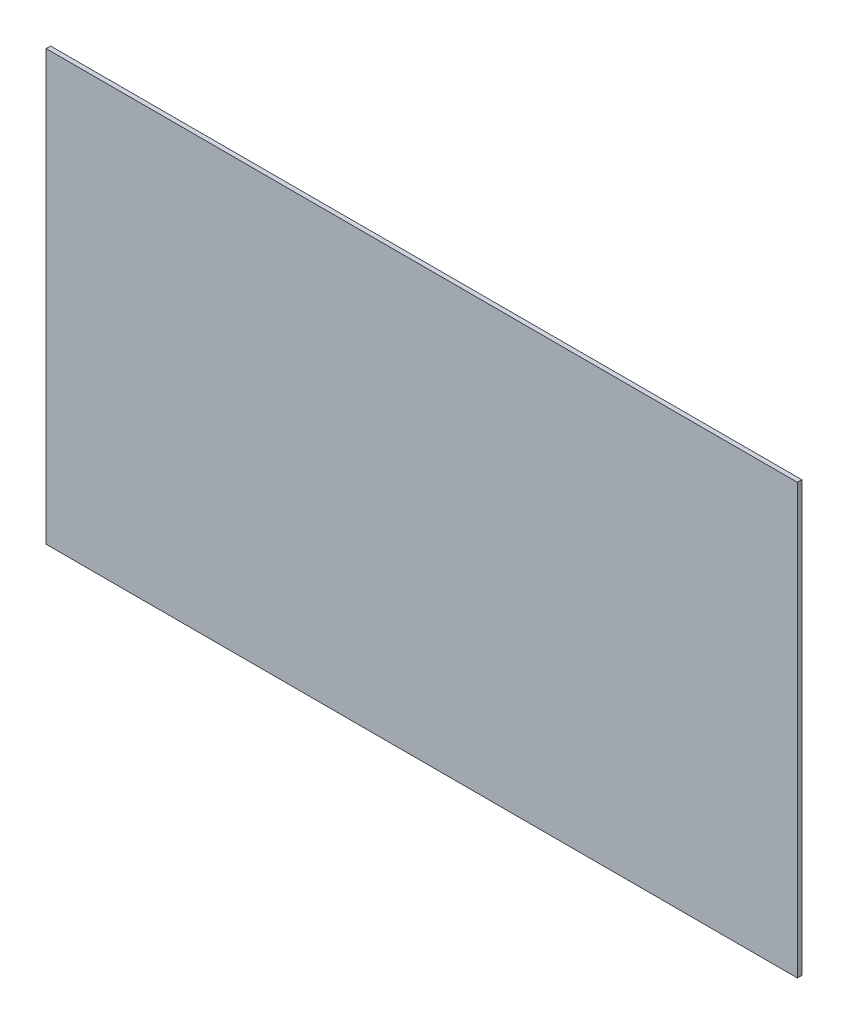
ISO-10303-21;
HEADER;
FILE_DESCRIPTION(('STEP AP214'),'2;1');
FILE_NAME('part.step','',(''),(''),'','','');
FILE_SCHEMA(('AUTOMOTIVE_DESIGN { 1 0 10303 214 1 1 1 1 }'));
ENDSEC;
DATA;
#1=APPLICATION_CONTEXT('core data for automotive mechanical design processes');
#2=APPLICATION_PROTOCOL_DEFINITION('international standard','automotive_design',2000,#1);
#3=PRODUCT_CONTEXT('',#1,'mechanical');
#4=PRODUCT('Part','Part','',(#3));
#5=PRODUCT_RELATED_PRODUCT_CATEGORY('part','',(#4));
#6=PRODUCT_DEFINITION_FORMATION('','',#4);
#7=PRODUCT_DEFINITION_CONTEXT('part definition',#1,'design');
#8=PRODUCT_DEFINITION('design','',#6,#7);
#9=PRODUCT_DEFINITION_SHAPE('','',#8);
#10=(LENGTH_UNIT() NAMED_UNIT(*) SI_UNIT(.MILLI.,.METRE.));
#11=(NAMED_UNIT(*) PLANE_ANGLE_UNIT() SI_UNIT($,.RADIAN.));
#12=(NAMED_UNIT(*) SI_UNIT($,.STERADIAN.) SOLID_ANGLE_UNIT());
#13=UNCERTAINTY_MEASURE_WITH_UNIT(LENGTH_MEASURE(1.E-05),#10,'distance_accuracy_value','');
#14=(GEOMETRIC_REPRESENTATION_CONTEXT(3) GLOBAL_UNCERTAINTY_ASSIGNED_CONTEXT((#13)) GLOBAL_UNIT_ASSIGNED_CONTEXT((#10,
#11,#12)) REPRESENTATION_CONTEXT('',''));
#15=CARTESIAN_POINT('',(0.,0.,0.));
#16=DIRECTION('',(0.,0.,1.));
#17=DIRECTION('',(1.,0.,0.));
#18=AXIS2_PLACEMENT_3D('',#15,#16,#17);
#19=CARTESIAN_POINT('',(0.,609.6,6.35));
#20=DIRECTION('',(-1.,0.,0.));
#21=DIRECTION('',(0.,-1.,0.));
#22=AXIS2_PLACEMENT_3D('',#19,#20,#21);
#23=PLANE('',#22);
#24=DIRECTION('',(0.,1.,0.));
#25=VECTOR('',#24,1.);
#26=CARTESIAN_POINT('',(0.,609.6,0.));
#27=LINE('',#26,#25);
#28=CARTESIAN_POINT('',(0.,0.,0.));
#29=VERTEX_POINT('',#28);
#30=CARTESIAN_POINT('',(0.,609.6,0.));
#31=VERTEX_POINT('',#30);
#32=EDGE_CURVE('E107',#29,#31,#27,.T.);
#33=ORIENTED_EDGE('',*,*,#32,.T.);
#34=DIRECTION('',(0.,0.,-1.));
#35=VECTOR('',#34,1.);
#36=CARTESIAN_POINT('',(0.,609.6,6.35));
#37=LINE('',#36,#35);
#38=CARTESIAN_POINT('',(0.,609.6,6.35));
#39=VERTEX_POINT('',#38);
#40=EDGE_CURVE('E11',#39,#31,#37,.T.);
#41=ORIENTED_EDGE('',*,*,#40,.F.);
#42=DIRECTION('',(0.,1.,0.));
#43=VECTOR('',#42,1.);
#44=CARTESIAN_POINT('',(0.,609.6,6.35));
#45=LINE('',#44,#43);
#46=CARTESIAN_POINT('',(0.,0.,6.35));
#47=VERTEX_POINT('',#46);
#48=EDGE_CURVE('E91',#47,#39,#45,.T.);
#49=ORIENTED_EDGE('',*,*,#48,.F.);
#50=DIRECTION('',(0.,0.,-1.));
#51=VECTOR('',#50,1.);
#52=CARTESIAN_POINT('',(0.,0.,6.35));
#53=LINE('',#52,#51);
#54=EDGE_CURVE('E103',#47,#29,#53,.T.);
#55=ORIENTED_EDGE('',*,*,#54,.T.);
#56=EDGE_LOOP('',(#33,#41,#49,#55));
#57=FACE_BOUND('',#56,.T.);
#58=ADVANCED_FACE('F39',(#57),#23,.F.);
#59=CARTESIAN_POINT('',(-1066.8,609.6,6.35));
#60=DIRECTION('',(0.,-1.,0.));
#61=DIRECTION('',(0.,0.,-1.));
#62=AXIS2_PLACEMENT_3D('',#59,#60,#61);
#63=PLANE('',#62);
#64=DIRECTION('',(-1.,0.,0.));
#65=VECTOR('',#64,1.);
#66=CARTESIAN_POINT('',(-1066.8,609.6,0.));
#67=LINE('',#66,#65);
#68=CARTESIAN_POINT('',(-1066.8,609.6,0.));
#69=VERTEX_POINT('',#68);
#70=EDGE_CURVE('E96',#31,#69,#67,.T.);
#71=ORIENTED_EDGE('',*,*,#70,.T.);
#72=DIRECTION('',(0.,0.,-1.));
#73=VECTOR('',#72,1.);
#74=CARTESIAN_POINT('',(-1066.8,609.6,6.35));
#75=LINE('',#74,#73);
#76=CARTESIAN_POINT('',(-1066.8,609.6,6.35));
#77=VERTEX_POINT('',#76);
#78=EDGE_CURVE('E48',#77,#69,#75,.T.);
#79=ORIENTED_EDGE('',*,*,#78,.F.);
#80=DIRECTION('',(-1.,0.,0.));
#81=VECTOR('',#80,1.);
#82=CARTESIAN_POINT('',(-1066.8,609.6,6.35));
#83=LINE('',#82,#81);
#84=EDGE_CURVE('E86',#39,#77,#83,.T.);
#85=ORIENTED_EDGE('',*,*,#84,.F.);
#86=ORIENTED_EDGE('',*,*,#40,.T.);
#87=EDGE_LOOP('',(#71,#79,#85,#86));
#88=FACE_BOUND('',#87,.T.);
#89=ADVANCED_FACE('F95',(#88),#63,.F.);
#90=CARTESIAN_POINT('',(-1066.8,0.,6.35));
#91=DIRECTION('',(1.,0.,0.));
#92=DIRECTION('',(0.,0.,-1.));
#93=AXIS2_PLACEMENT_3D('',#90,#91,#92);
#94=PLANE('',#93);
#95=DIRECTION('',(0.,-1.,0.));
#96=VECTOR('',#95,1.);
#97=CARTESIAN_POINT('',(-1066.8,0.,0.));
#98=LINE('',#97,#96);
#99=CARTESIAN_POINT('',(-1066.8,0.,0.));
#100=VERTEX_POINT('',#99);
#101=EDGE_CURVE('E73',#69,#100,#98,.T.);
#102=ORIENTED_EDGE('',*,*,#101,.T.);
#103=DIRECTION('',(0.,0.,-1.));
#104=VECTOR('',#103,1.);
#105=CARTESIAN_POINT('',(-1066.8,0.,6.35));
#106=LINE('',#105,#104);
#107=CARTESIAN_POINT('',(-1066.8,0.,6.35));
#108=VERTEX_POINT('',#107);
#109=EDGE_CURVE('E98',#108,#100,#106,.T.);
#110=ORIENTED_EDGE('',*,*,#109,.F.);
#111=DIRECTION('',(0.,-1.,0.));
#112=VECTOR('',#111,1.);
#113=CARTESIAN_POINT('',(-1066.8,0.,6.35));
#114=LINE('',#113,#112);
#115=EDGE_CURVE('E89',#77,#108,#114,.T.);
#116=ORIENTED_EDGE('',*,*,#115,.F.);
#117=ORIENTED_EDGE('',*,*,#78,.T.);
#118=EDGE_LOOP('',(#102,#110,#116,#117));
#119=FACE_BOUND('',#118,.T.);
#120=ADVANCED_FACE('F99',(#119),#94,.F.);
#121=CARTESIAN_POINT('',(0.,0.,6.35));
#122=DIRECTION('',(0.,1.,0.));
#123=DIRECTION('',(0.,0.,1.));
#124=AXIS2_PLACEMENT_3D('',#121,#122,#123);
#125=PLANE('',#124);
#126=DIRECTION('',(1.,0.,0.));
#127=VECTOR('',#126,1.);
#128=CARTESIAN_POINT('',(0.,0.,0.));
#129=LINE('',#128,#127);
#130=EDGE_CURVE('E79',#100,#29,#129,.T.);
#131=ORIENTED_EDGE('',*,*,#130,.T.);
#132=ORIENTED_EDGE('',*,*,#54,.F.);
#133=DIRECTION('',(1.,0.,0.));
#134=VECTOR('',#133,1.);
#135=CARTESIAN_POINT('',(0.,0.,6.35));
#136=LINE('',#135,#134);
#137=EDGE_CURVE('E56',#108,#47,#136,.T.);
#138=ORIENTED_EDGE('',*,*,#137,.F.);
#139=ORIENTED_EDGE('',*,*,#109,.T.);
#140=EDGE_LOOP('',(#131,#132,#138,#139));
#141=FACE_BOUND('',#140,.T.);
#142=ADVANCED_FACE('F120',(#141),#125,.F.);
#143=CARTESIAN_POINT('',(0.,0.,6.35));
#144=DIRECTION('',(0.,0.,-1.));
#145=DIRECTION('',(-1.,0.,0.));
#146=AXIS2_PLACEMENT_3D('',#143,#144,#145);
#147=PLANE('',#146);
#148=ORIENTED_EDGE('',*,*,#48,.T.);
#149=ORIENTED_EDGE('',*,*,#84,.T.);
#150=ORIENTED_EDGE('',*,*,#115,.T.);
#151=ORIENTED_EDGE('',*,*,#137,.T.);
#152=EDGE_LOOP('',(#148,#149,#150,#151));
#153=FACE_BOUND('',#152,.T.);
#154=ADVANCED_FACE('F87',(#153),#147,.F.);
#155=CARTESIAN_POINT('',(0.,0.,0.));
#156=DIRECTION('',(0.,0.,-1.));
#157=DIRECTION('',(-1.,0.,0.));
#158=AXIS2_PLACEMENT_3D('',#155,#156,#157);
#159=PLANE('',#158);
#160=ORIENTED_EDGE('',*,*,#32,.F.);
#161=ORIENTED_EDGE('',*,*,#130,.F.);
#162=ORIENTED_EDGE('',*,*,#101,.F.);
#163=ORIENTED_EDGE('',*,*,#70,.F.);
#164=EDGE_LOOP('',(#160,#161,#162,#163));
#165=FACE_BOUND('',#164,.T.);
#166=ADVANCED_FACE('F123',(#165),#159,.T.);
#167=CLOSED_SHELL('',(#58,#89,#120,#142,#154,#166));
#168=MANIFOLD_SOLID_BREP('B2',#167);
#169=ADVANCED_BREP_SHAPE_REPRESENTATION('',(#18,#168),#14);
#170=SHAPE_DEFINITION_REPRESENTATION(#9,#169);
ENDSEC;
END-ISO-10303-21;
